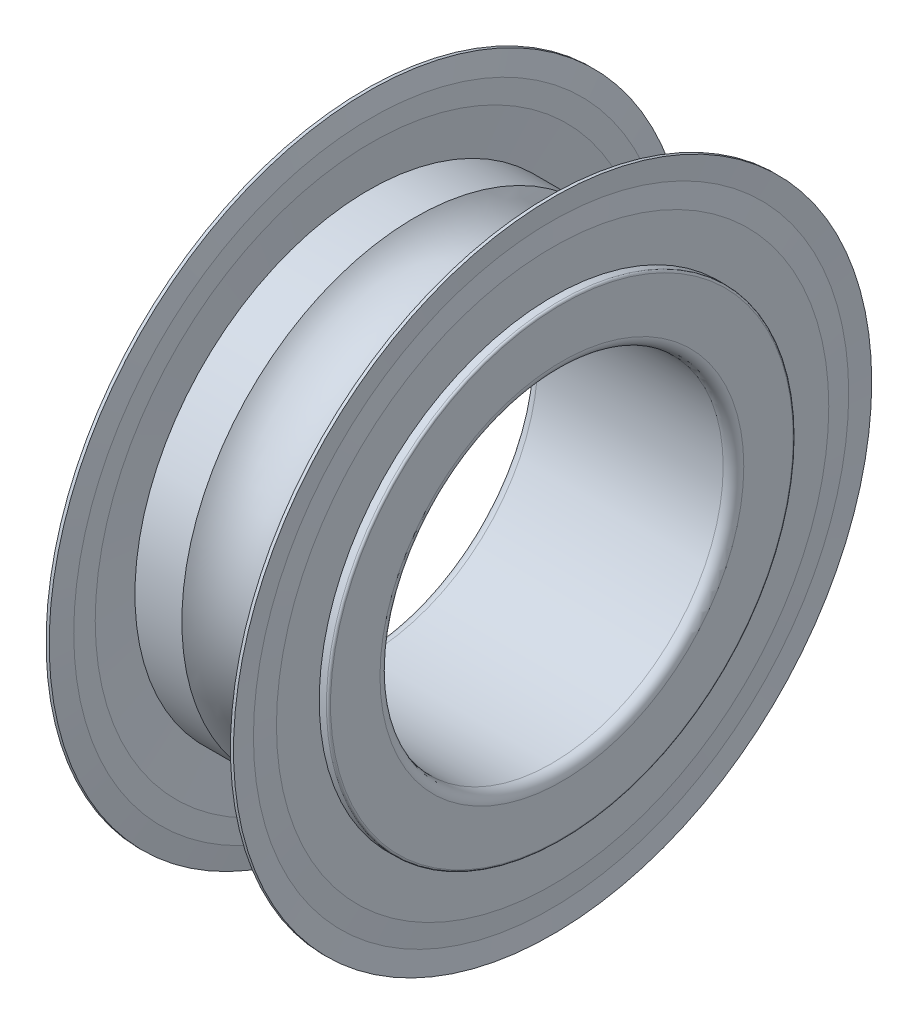
ISO-10303-21;
HEADER;
FILE_DESCRIPTION(('STEP AP214'),'2;1');
FILE_NAME('part.step','',(''),(''),'','','');
FILE_SCHEMA(('AUTOMOTIVE_DESIGN { 1 0 10303 214 1 1 1 1 }'));
ENDSEC;
DATA;
#1=APPLICATION_CONTEXT('core data for automotive mechanical design processes');
#2=APPLICATION_PROTOCOL_DEFINITION('international standard','automotive_design',2000,#1);
#3=PRODUCT_CONTEXT('',#1,'mechanical');
#4=PRODUCT('Part','Part','',(#3));
#5=PRODUCT_RELATED_PRODUCT_CATEGORY('part','',(#4));
#6=PRODUCT_DEFINITION_FORMATION('','',#4);
#7=PRODUCT_DEFINITION_CONTEXT('part definition',#1,'design');
#8=PRODUCT_DEFINITION('design','',#6,#7);
#9=PRODUCT_DEFINITION_SHAPE('','',#8);
#10=(LENGTH_UNIT() NAMED_UNIT(*) SI_UNIT(.MILLI.,.METRE.));
#11=(NAMED_UNIT(*) PLANE_ANGLE_UNIT() SI_UNIT($,.RADIAN.));
#12=(NAMED_UNIT(*) SI_UNIT($,.STERADIAN.) SOLID_ANGLE_UNIT());
#13=UNCERTAINTY_MEASURE_WITH_UNIT(LENGTH_MEASURE(1.E-05),#10,'distance_accuracy_value','');
#14=(GEOMETRIC_REPRESENTATION_CONTEXT(3) GLOBAL_UNCERTAINTY_ASSIGNED_CONTEXT((#13)) GLOBAL_UNIT_ASSIGNED_CONTEXT((#10,
#11,#12)) REPRESENTATION_CONTEXT('',''));
#15=CARTESIAN_POINT('',(0.,0.,0.));
#16=DIRECTION('',(0.,0.,1.));
#17=DIRECTION('',(1.,0.,0.));
#18=AXIS2_PLACEMENT_3D('',#15,#16,#17);
#19=CARTESIAN_POINT('',(50.,0.,0.));
#20=DIRECTION('',(1.,0.,0.));
#21=DIRECTION('',(0.,0.,-1.));
#22=AXIS2_PLACEMENT_3D('',#19,#20,#21);
#23=CYLINDRICAL_SURFACE('',#22,18.595);
#24=CARTESIAN_POINT('',(11.46,0.,0.));
#25=DIRECTION('',(1.,0.,0.));
#26=DIRECTION('',(0.,0.,-1.));
#27=AXIS2_PLACEMENT_3D('',#24,#25,#26);
#28=CIRCLE('',#27,18.595);
#29=CARTESIAN_POINT('',(11.46,0.,-18.595));
#30=VERTEX_POINT('',#29);
#31=EDGE_CURVE('E11',#30,#30,#28,.T.);
#32=ORIENTED_EDGE('',*,*,#31,.F.);
#33=EDGE_LOOP('',(#32));
#34=FACE_BOUND('',#33,.T.);
#35=CARTESIAN_POINT('',(11.28,0.,0.));
#36=DIRECTION('',(1.,0.,0.));
#37=DIRECTION('',(0.,0.,-1.));
#38=AXIS2_PLACEMENT_3D('',#35,#36,#37);
#39=CIRCLE('',#38,18.595);
#40=CARTESIAN_POINT('',(11.28,0.,-18.595));
#41=VERTEX_POINT('',#40);
#42=EDGE_CURVE('E145',#41,#41,#39,.T.);
#43=ORIENTED_EDGE('',*,*,#42,.T.);
#44=EDGE_LOOP('',(#43));
#45=FACE_BOUND('',#44,.T.);
#46=ADVANCED_FACE('F17',(#34,#45),#23,.T.);
#47=CARTESIAN_POINT('',(11.37,0.,0.));
#48=DIRECTION('',(1.,0.,0.));
#49=DIRECTION('',(0.,0.,-1.));
#50=AXIS2_PLACEMENT_3D('',#47,#48,#49);
#51=CONICAL_SURFACE('',#50,17.34375,1.49899191472693);
#52=CARTESIAN_POINT('',(11.37,0.,0.));
#53=DIRECTION('',(1.,0.,0.));
#54=DIRECTION('',(0.,0.,-1.));
#55=AXIS2_PLACEMENT_3D('',#52,#53,#54);
#56=CIRCLE('',#55,17.34375);
#57=CARTESIAN_POINT('',(11.37,0.,-17.34375));
#58=VERTEX_POINT('',#57);
#59=EDGE_CURVE('E27',#58,#58,#56,.T.);
#60=ORIENTED_EDGE('',*,*,#59,.F.);
#61=EDGE_LOOP('',(#60));
#62=FACE_BOUND('',#61,.T.);
#63=ORIENTED_EDGE('',*,*,#31,.T.);
#64=EDGE_LOOP('',(#63));
#65=FACE_BOUND('',#64,.T.);
#66=ADVANCED_FACE('F280',(#62,#65),#51,.F.);
#67=CARTESIAN_POINT('',(11.46,0.,0.));
#68=DIRECTION('',(-1.,0.,0.));
#69=DIRECTION('',(0.,0.,1.));
#70=AXIS2_PLACEMENT_3D('',#67,#68,#69);
#71=CONICAL_SURFACE('',#70,16.0925,1.49899191472693);
#72=CARTESIAN_POINT('',(11.46,0.,0.));
#73=DIRECTION('',(1.,0.,0.));
#74=DIRECTION('',(0.,0.,-1.));
#75=AXIS2_PLACEMENT_3D('',#72,#73,#74);
#76=CIRCLE('',#75,16.0925);
#77=CARTESIAN_POINT('',(11.46,0.,-16.0925));
#78=VERTEX_POINT('',#77);
#79=EDGE_CURVE('E159',#78,#78,#76,.T.);
#80=ORIENTED_EDGE('',*,*,#79,.F.);
#81=EDGE_LOOP('',(#80));
#82=FACE_BOUND('',#81,.T.);
#83=ORIENTED_EDGE('',*,*,#59,.T.);
#84=EDGE_LOOP('',(#83));
#85=FACE_BOUND('',#84,.T.);
#86=ADVANCED_FACE('F270',(#82,#85),#71,.T.);
#87=CARTESIAN_POINT('',(11.46,13.59,0.));
#88=DIRECTION('',(1.,0.,0.));
#89=DIRECTION('',(0.,1.,0.));
#90=AXIS2_PLACEMENT_3D('',#87,#88,#89);
#91=PLANE('',#90);
#92=CARTESIAN_POINT('',(11.46,0.,0.));
#93=DIRECTION('',(-1.,0.,0.));
#94=DIRECTION('',(0.,0.,-1.));
#95=AXIS2_PLACEMENT_3D('',#92,#93,#94);
#96=CIRCLE('',#95,13.6);
#97=CARTESIAN_POINT('',(11.46,0.,-13.6));
#98=VERTEX_POINT('',#97);
#99=EDGE_CURVE('E112',#98,#98,#96,.T.);
#100=ORIENTED_EDGE('',*,*,#99,.T.);
#101=EDGE_LOOP('',(#100));
#102=FACE_BOUND('',#101,.T.);
#103=ORIENTED_EDGE('',*,*,#79,.T.);
#104=EDGE_LOOP('',(#103));
#105=FACE_BOUND('',#104,.T.);
#106=ADVANCED_FACE('F267',(#102,#105),#91,.T.);
#107=CARTESIAN_POINT('',(11.1,0.,0.));
#108=DIRECTION('',(-1.,0.,0.));
#109=DIRECTION('',(0.,0.,1.));
#110=AXIS2_PLACEMENT_3D('',#107,#108,#109);
#111=CONICAL_SURFACE('',#110,16.0925,1.49899191472693);
#112=CARTESIAN_POINT('',(11.1,0.,0.));
#113=DIRECTION('',(1.,0.,0.));
#114=DIRECTION('',(0.,0.,-1.));
#115=AXIS2_PLACEMENT_3D('',#112,#113,#114);
#116=CIRCLE('',#115,16.0925);
#117=CARTESIAN_POINT('',(11.1,0.,-16.0925));
#118=VERTEX_POINT('',#117);
#119=EDGE_CURVE('E161',#118,#118,#116,.T.);
#120=ORIENTED_EDGE('',*,*,#119,.F.);
#121=EDGE_LOOP('',(#120));
#122=FACE_BOUND('',#121,.T.);
#123=CARTESIAN_POINT('',(11.2792807192807,0.,0.));
#124=DIRECTION('',(1.,0.,0.));
#125=DIRECTION('',(0.,0.,1.));
#126=AXIS2_PLACEMENT_3D('',#123,#124,#125);
#127=CIRCLE('',#126,13.6);
#128=CARTESIAN_POINT('',(11.2792807192807,0.,13.6));
#129=VERTEX_POINT('',#128);
#130=EDGE_CURVE('E136',#129,#129,#127,.T.);
#131=ORIENTED_EDGE('',*,*,#130,.T.);
#132=EDGE_LOOP('',(#131));
#133=FACE_BOUND('',#132,.T.);
#134=ADVANCED_FACE('F269',(#122,#133),#111,.F.);
#135=CARTESIAN_POINT('',(11.1,17.34375,0.));
#136=DIRECTION('',(-1.,0.,0.));
#137=DIRECTION('',(0.,0.,1.));
#138=AXIS2_PLACEMENT_3D('',#135,#136,#137);
#139=PLANE('',#138);
#140=CARTESIAN_POINT('',(11.1,0.,0.));
#141=DIRECTION('',(1.,0.,0.));
#142=DIRECTION('',(0.,0.,-1.));
#143=AXIS2_PLACEMENT_3D('',#140,#141,#142);
#144=CIRCLE('',#143,17.34375);
#145=CARTESIAN_POINT('',(11.1,0.,-17.34375));
#146=VERTEX_POINT('',#145);
#147=EDGE_CURVE('E143',#146,#146,#144,.T.);
#148=ORIENTED_EDGE('',*,*,#147,.F.);
#149=EDGE_LOOP('',(#148));
#150=FACE_BOUND('',#149,.T.);
#151=ORIENTED_EDGE('',*,*,#119,.T.);
#152=EDGE_LOOP('',(#151));
#153=FACE_BOUND('',#152,.T.);
#154=ADVANCED_FACE('F277',(#150,#153),#139,.T.);
#155=CARTESIAN_POINT('',(11.28,0.,0.));
#156=DIRECTION('',(1.,0.,0.));
#157=DIRECTION('',(0.,0.,-1.));
#158=AXIS2_PLACEMENT_3D('',#155,#156,#157);
#159=CONICAL_SURFACE('',#158,18.595,1.42792038843124);
#160=ORIENTED_EDGE('',*,*,#42,.F.);
#161=EDGE_LOOP('',(#160));
#162=FACE_BOUND('',#161,.T.);
#163=ORIENTED_EDGE('',*,*,#147,.T.);
#164=EDGE_LOOP('',(#163));
#165=FACE_BOUND('',#164,.T.);
#166=ADVANCED_FACE('F293',(#162,#165),#159,.T.);
#167=CARTESIAN_POINT('',(0.9,0.,0.));
#168=DIRECTION('',(-1.,0.,0.));
#169=DIRECTION('',(0.,0.,1.));
#170=AXIS2_PLACEMENT_3D('',#167,#168,#169);
#171=CONICAL_SURFACE('',#170,17.34375,1.42792038843124);
#172=CARTESIAN_POINT('',(0.9,0.,0.));
#173=DIRECTION('',(1.,0.,0.));
#174=DIRECTION('',(0.,0.,-1.));
#175=AXIS2_PLACEMENT_3D('',#172,#173,#174);
#176=CIRCLE('',#175,17.34375);
#177=CARTESIAN_POINT('',(0.9,0.,-17.34375));
#178=VERTEX_POINT('',#177);
#179=EDGE_CURVE('E124',#178,#178,#176,.T.);
#180=ORIENTED_EDGE('',*,*,#179,.F.);
#181=EDGE_LOOP('',(#180));
#182=FACE_BOUND('',#181,.T.);
#183=CARTESIAN_POINT('',(0.72,0.,0.));
#184=DIRECTION('',(1.,0.,0.));
#185=DIRECTION('',(0.,0.,-1.));
#186=AXIS2_PLACEMENT_3D('',#183,#184,#185);
#187=CIRCLE('',#186,18.595);
#188=CARTESIAN_POINT('',(0.72,0.,-18.595));
#189=VERTEX_POINT('',#188);
#190=EDGE_CURVE('E151',#189,#189,#187,.T.);
#191=ORIENTED_EDGE('',*,*,#190,.T.);
#192=EDGE_LOOP('',(#191));
#193=FACE_BOUND('',#192,.T.);
#194=ADVANCED_FACE('F296',(#182,#193),#171,.T.);
#195=CARTESIAN_POINT('',(0.9,16.0925,0.));
#196=DIRECTION('',(1.,0.,0.));
#197=DIRECTION('',(0.,1.,0.));
#198=AXIS2_PLACEMENT_3D('',#195,#196,#197);
#199=PLANE('',#198);
#200=CARTESIAN_POINT('',(0.9,0.,0.));
#201=DIRECTION('',(1.,0.,0.));
#202=DIRECTION('',(0.,0.,-1.));
#203=AXIS2_PLACEMENT_3D('',#200,#201,#202);
#204=CIRCLE('',#203,16.0925);
#205=CARTESIAN_POINT('',(0.9,0.,-16.0925));
#206=VERTEX_POINT('',#205);
#207=EDGE_CURVE('E155',#206,#206,#204,.T.);
#208=ORIENTED_EDGE('',*,*,#207,.F.);
#209=EDGE_LOOP('',(#208));
#210=FACE_BOUND('',#209,.T.);
#211=ORIENTED_EDGE('',*,*,#179,.T.);
#212=EDGE_LOOP('',(#211));
#213=FACE_BOUND('',#212,.T.);
#214=ADVANCED_FACE('F315',(#210,#213),#199,.T.);
#215=CARTESIAN_POINT('',(0.72,0.,0.));
#216=DIRECTION('',(1.,0.,0.));
#217=DIRECTION('',(0.,0.,-1.));
#218=AXIS2_PLACEMENT_3D('',#215,#216,#217);
#219=CONICAL_SURFACE('',#218,13.59,1.49899191472693);
#220=CARTESIAN_POINT('',(0.720719280719279,0.,0.));
#221=DIRECTION('',(-1.,0.,0.));
#222=DIRECTION('',(0.,0.,-1.));
#223=AXIS2_PLACEMENT_3D('',#220,#221,#222);
#224=CIRCLE('',#223,13.6);
#225=CARTESIAN_POINT('',(0.720719280719279,0.,-13.6));
#226=VERTEX_POINT('',#225);
#227=EDGE_CURVE('E20',#226,#226,#224,.T.);
#228=ORIENTED_EDGE('',*,*,#227,.T.);
#229=EDGE_LOOP('',(#228));
#230=FACE_BOUND('',#229,.T.);
#231=ORIENTED_EDGE('',*,*,#207,.T.);
#232=EDGE_LOOP('',(#231));
#233=FACE_BOUND('',#232,.T.);
#234=ADVANCED_FACE('F312',(#230,#233),#219,.F.);
#235=CARTESIAN_POINT('',(0.54,16.0925,0.));
#236=DIRECTION('',(-1.,0.,0.));
#237=DIRECTION('',(0.,0.,1.));
#238=AXIS2_PLACEMENT_3D('',#235,#236,#237);
#239=PLANE('',#238);
#240=CARTESIAN_POINT('',(0.54,0.,0.));
#241=DIRECTION('',(1.,0.,0.));
#242=DIRECTION('',(0.,0.,-1.));
#243=AXIS2_PLACEMENT_3D('',#240,#241,#242);
#244=CIRCLE('',#243,16.0925);
#245=CARTESIAN_POINT('',(0.54,0.,-16.0925));
#246=VERTEX_POINT('',#245);
#247=EDGE_CURVE('E158',#246,#246,#244,.T.);
#248=ORIENTED_EDGE('',*,*,#247,.F.);
#249=EDGE_LOOP('',(#248));
#250=FACE_BOUND('',#249,.T.);
#251=CARTESIAN_POINT('',(0.54,0.,0.));
#252=DIRECTION('',(1.,0.,0.));
#253=DIRECTION('',(0.,0.,1.));
#254=AXIS2_PLACEMENT_3D('',#251,#252,#253);
#255=CIRCLE('',#254,13.6);
#256=CARTESIAN_POINT('',(0.54,0.,13.6));
#257=VERTEX_POINT('',#256);
#258=EDGE_CURVE('E135',#257,#257,#255,.T.);
#259=ORIENTED_EDGE('',*,*,#258,.T.);
#260=EDGE_LOOP('',(#259));
#261=FACE_BOUND('',#260,.T.);
#262=ADVANCED_FACE('F198',(#250,#261),#239,.T.);
#263=CARTESIAN_POINT('',(0.63,0.,0.));
#264=DIRECTION('',(1.,0.,0.));
#265=DIRECTION('',(0.,0.,-1.));
#266=AXIS2_PLACEMENT_3D('',#263,#264,#265);
#267=CONICAL_SURFACE('',#266,17.34375,1.49899191472693);
#268=CARTESIAN_POINT('',(0.63,0.,0.));
#269=DIRECTION('',(1.,0.,0.));
#270=DIRECTION('',(0.,0.,-1.));
#271=AXIS2_PLACEMENT_3D('',#268,#269,#270);
#272=CIRCLE('',#271,17.34375);
#273=CARTESIAN_POINT('',(0.63,0.,-17.34375));
#274=VERTEX_POINT('',#273);
#275=EDGE_CURVE('E153',#274,#274,#272,.T.);
#276=ORIENTED_EDGE('',*,*,#275,.F.);
#277=EDGE_LOOP('',(#276));
#278=FACE_BOUND('',#277,.T.);
#279=ORIENTED_EDGE('',*,*,#247,.T.);
#280=EDGE_LOOP('',(#279));
#281=FACE_BOUND('',#280,.T.);
#282=ADVANCED_FACE('F310',(#278,#281),#267,.T.);
#283=CARTESIAN_POINT('',(0.54,0.,0.));
#284=DIRECTION('',(-1.,0.,0.));
#285=DIRECTION('',(0.,0.,1.));
#286=AXIS2_PLACEMENT_3D('',#283,#284,#285);
#287=CONICAL_SURFACE('',#286,18.595,1.49899191472693);
#288=CARTESIAN_POINT('',(0.54,0.,0.));
#289=DIRECTION('',(1.,0.,0.));
#290=DIRECTION('',(0.,0.,-1.));
#291=AXIS2_PLACEMENT_3D('',#288,#289,#290);
#292=CIRCLE('',#291,18.595);
#293=CARTESIAN_POINT('',(0.54,0.,-18.595));
#294=VERTEX_POINT('',#293);
#295=EDGE_CURVE('E118',#294,#294,#292,.T.);
#296=ORIENTED_EDGE('',*,*,#295,.F.);
#297=EDGE_LOOP('',(#296));
#298=FACE_BOUND('',#297,.T.);
#299=ORIENTED_EDGE('',*,*,#275,.T.);
#300=EDGE_LOOP('',(#299));
#301=FACE_BOUND('',#300,.T.);
#302=ADVANCED_FACE('F306',(#298,#301),#287,.F.);
#303=CARTESIAN_POINT('',(50.,0.,0.));
#304=DIRECTION('',(1.,0.,0.));
#305=DIRECTION('',(0.,0.,-1.));
#306=AXIS2_PLACEMENT_3D('',#303,#304,#305);
#307=CYLINDRICAL_SURFACE('',#306,18.595);
#308=ORIENTED_EDGE('',*,*,#190,.F.);
#309=EDGE_LOOP('',(#308));
#310=FACE_BOUND('',#309,.T.);
#311=ORIENTED_EDGE('',*,*,#295,.T.);
#312=EDGE_LOOP('',(#311));
#313=FACE_BOUND('',#312,.T.);
#314=ADVANCED_FACE('F309',(#310,#313),#307,.T.);
#315=CARTESIAN_POINT('',(50.,0.,0.));
#316=DIRECTION('',(1.,0.,0.));
#317=DIRECTION('',(0.,0.,-1.));
#318=AXIS2_PLACEMENT_3D('',#315,#316,#317);
#319=CYLINDRICAL_SURFACE('',#318,13.6);
#320=CARTESIAN_POINT('',(3.45625767814427,0.,0.));
#321=DIRECTION('',(1.,0.,0.));
#322=DIRECTION('',(0.,0.,-1.));
#323=AXIS2_PLACEMENT_3D('',#320,#321,#322);
#324=CIRCLE('',#323,13.6);
#325=CARTESIAN_POINT('',(3.45625767814427,0.,-13.6));
#326=VERTEX_POINT('',#325);
#327=EDGE_CURVE('E107',#326,#326,#324,.T.);
#328=ORIENTED_EDGE('',*,*,#327,.F.);
#329=EDGE_LOOP('',(#328));
#330=FACE_BOUND('',#329,.T.);
#331=ORIENTED_EDGE('',*,*,#227,.F.);
#332=EDGE_LOOP('',(#331));
#333=FACE_BOUND('',#332,.T.);
#334=ADVANCED_FACE('F321',(#330,#333),#319,.T.);
#335=CARTESIAN_POINT('',(6.,0.,0.));
#336=DIRECTION('',(1.,0.,0.));
#337=DIRECTION('',(0.,0.,-1.));
#338=AXIS2_PLACEMENT_3D('',#335,#336,#337);
#339=TOROIDAL_SURFACE('',#338,15.5,3.175);
#340=ORIENTED_EDGE('',*,*,#327,.T.);
#341=EDGE_LOOP('',(#340));
#342=FACE_BOUND('',#341,.T.);
#343=CARTESIAN_POINT('',(8.54374232185574,0.,0.));
#344=DIRECTION('',(1.,0.,0.));
#345=DIRECTION('',(0.,0.,-1.));
#346=AXIS2_PLACEMENT_3D('',#343,#344,#345);
#347=CIRCLE('',#346,13.6);
#348=CARTESIAN_POINT('',(8.54374232185574,0.,-13.6));
#349=VERTEX_POINT('',#348);
#350=EDGE_CURVE('E189',#349,#349,#347,.T.);
#351=ORIENTED_EDGE('',*,*,#350,.F.);
#352=EDGE_LOOP('',(#351));
#353=FACE_BOUND('',#352,.T.);
#354=ADVANCED_FACE('F108',(#342,#353),#339,.F.);
#355=CARTESIAN_POINT('',(50.,0.,0.));
#356=DIRECTION('',(1.,0.,0.));
#357=DIRECTION('',(0.,0.,-1.));
#358=AXIS2_PLACEMENT_3D('',#355,#356,#357);
#359=CYLINDRICAL_SURFACE('',#358,13.6);
#360=CARTESIAN_POINT('',(11.88,0.,0.));
#361=DIRECTION('',(1.,0.,0.));
#362=DIRECTION('',(0.,0.,-1.));
#363=AXIS2_PLACEMENT_3D('',#360,#361,#362);
#364=CIRCLE('',#363,13.6);
#365=CARTESIAN_POINT('',(11.88,0.,-13.6));
#366=VERTEX_POINT('',#365);
#367=EDGE_CURVE('E120',#366,#366,#364,.T.);
#368=ORIENTED_EDGE('',*,*,#367,.F.);
#369=EDGE_LOOP('',(#368));
#370=FACE_BOUND('',#369,.T.);
#371=ORIENTED_EDGE('',*,*,#99,.F.);
#372=EDGE_LOOP('',(#371));
#373=FACE_BOUND('',#372,.T.);
#374=ADVANCED_FACE('F257',(#370,#373),#359,.T.);
#375=CARTESIAN_POINT('',(11.88,0.,0.));
#376=DIRECTION('',(1.,0.,0.));
#377=DIRECTION('',(0.,0.,-1.));
#378=AXIS2_PLACEMENT_3D('',#375,#376,#377);
#379=TOROIDAL_SURFACE('',#378,13.48,0.12);
#380=CARTESIAN_POINT('',(12.,0.,0.));
#381=DIRECTION('',(1.,0.,0.));
#382=DIRECTION('',(0.,0.,-1.));
#383=AXIS2_PLACEMENT_3D('',#380,#381,#382);
#384=CIRCLE('',#383,13.48);
#385=CARTESIAN_POINT('',(12.,0.,-13.48));
#386=VERTEX_POINT('',#385);
#387=EDGE_CURVE('E129',#386,#386,#384,.T.);
#388=ORIENTED_EDGE('',*,*,#387,.F.);
#389=EDGE_LOOP('',(#388));
#390=FACE_BOUND('',#389,.T.);
#391=ORIENTED_EDGE('',*,*,#367,.T.);
#392=EDGE_LOOP('',(#391));
#393=FACE_BOUND('',#392,.T.);
#394=ADVANCED_FACE('F251',(#390,#393),#379,.T.);
#395=CARTESIAN_POINT('',(12.,10.6,0.));
#396=DIRECTION('',(1.,0.,0.));
#397=DIRECTION('',(0.,1.,0.));
#398=AXIS2_PLACEMENT_3D('',#395,#396,#397);
#399=PLANE('',#398);
#400=CARTESIAN_POINT('',(12.,0.,0.));
#401=DIRECTION('',(1.,0.,0.));
#402=DIRECTION('',(0.,0.,-1.));
#403=AXIS2_PLACEMENT_3D('',#400,#401,#402);
#404=CIRCLE('',#403,10.6);
#405=CARTESIAN_POINT('',(12.,0.,-10.6));
#406=VERTEX_POINT('',#405);
#407=EDGE_CURVE('E126',#406,#406,#404,.T.);
#408=ORIENTED_EDGE('',*,*,#407,.F.);
#409=EDGE_LOOP('',(#408));
#410=FACE_BOUND('',#409,.T.);
#411=ORIENTED_EDGE('',*,*,#387,.T.);
#412=EDGE_LOOP('',(#411));
#413=FACE_BOUND('',#412,.T.);
#414=ADVANCED_FACE('F243',(#410,#413),#399,.T.);
#415=CARTESIAN_POINT('',(11.4,0.,0.));
#416=DIRECTION('',(1.,0.,0.));
#417=DIRECTION('',(0.,0.,-1.));
#418=AXIS2_PLACEMENT_3D('',#415,#416,#417);
#419=TOROIDAL_SURFACE('',#418,10.6,0.6);
#420=CARTESIAN_POINT('',(11.4,0.,0.));
#421=DIRECTION('',(1.,0.,0.));
#422=DIRECTION('',(0.,0.,-1.));
#423=AXIS2_PLACEMENT_3D('',#420,#421,#422);
#424=CIRCLE('',#423,10.);
#425=CARTESIAN_POINT('',(11.4,0.,-10.));
#426=VERTEX_POINT('',#425);
#427=EDGE_CURVE('E130',#426,#426,#424,.T.);
#428=ORIENTED_EDGE('',*,*,#427,.F.);
#429=EDGE_LOOP('',(#428));
#430=FACE_BOUND('',#429,.T.);
#431=ORIENTED_EDGE('',*,*,#407,.T.);
#432=EDGE_LOOP('',(#431));
#433=FACE_BOUND('',#432,.T.);
#434=ADVANCED_FACE('F237',(#430,#433),#419,.T.);
#435=CARTESIAN_POINT('',(50.,0.,0.));
#436=DIRECTION('',(1.,0.,0.));
#437=DIRECTION('',(0.,0.,-1.));
#438=AXIS2_PLACEMENT_3D('',#435,#436,#437);
#439=CYLINDRICAL_SURFACE('',#438,10.);
#440=CARTESIAN_POINT('',(0.6,0.,0.));
#441=DIRECTION('',(1.,0.,0.));
#442=DIRECTION('',(0.,0.,-1.));
#443=AXIS2_PLACEMENT_3D('',#440,#441,#442);
#444=CIRCLE('',#443,10.);
#445=CARTESIAN_POINT('',(0.6,0.,-10.));
#446=VERTEX_POINT('',#445);
#447=EDGE_CURVE('E141',#446,#446,#444,.T.);
#448=ORIENTED_EDGE('',*,*,#447,.F.);
#449=EDGE_LOOP('',(#448));
#450=FACE_BOUND('',#449,.T.);
#451=ORIENTED_EDGE('',*,*,#427,.T.);
#452=EDGE_LOOP('',(#451));
#453=FACE_BOUND('',#452,.T.);
#454=ADVANCED_FACE('F231',(#450,#453),#439,.F.);
#455=CARTESIAN_POINT('',(0.6,0.,0.));
#456=DIRECTION('',(1.,0.,0.));
#457=DIRECTION('',(0.,0.,-1.));
#458=AXIS2_PLACEMENT_3D('',#455,#456,#457);
#459=TOROIDAL_SURFACE('',#458,10.6,0.6);
#460=CARTESIAN_POINT('',(0.,0.,0.));
#461=DIRECTION('',(1.,0.,0.));
#462=DIRECTION('',(0.,0.,-1.));
#463=AXIS2_PLACEMENT_3D('',#460,#461,#462);
#464=CIRCLE('',#463,10.6);
#465=CARTESIAN_POINT('',(0.,0.,-10.6));
#466=VERTEX_POINT('',#465);
#467=EDGE_CURVE('E137',#466,#466,#464,.T.);
#468=ORIENTED_EDGE('',*,*,#467,.F.);
#469=EDGE_LOOP('',(#468));
#470=FACE_BOUND('',#469,.T.);
#471=ORIENTED_EDGE('',*,*,#447,.T.);
#472=EDGE_LOOP('',(#471));
#473=FACE_BOUND('',#472,.T.);
#474=ADVANCED_FACE('F225',(#470,#473),#459,.T.);
#475=CARTESIAN_POINT('',(0.,13.48,0.));
#476=DIRECTION('',(-1.,0.,0.));
#477=DIRECTION('',(0.,0.,1.));
#478=AXIS2_PLACEMENT_3D('',#475,#476,#477);
#479=PLANE('',#478);
#480=CARTESIAN_POINT('',(0.,0.,0.));
#481=DIRECTION('',(1.,0.,0.));
#482=DIRECTION('',(0.,0.,-1.));
#483=AXIS2_PLACEMENT_3D('',#480,#481,#482);
#484=CIRCLE('',#483,13.48);
#485=CARTESIAN_POINT('',(0.,0.,-13.48));
#486=VERTEX_POINT('',#485);
#487=EDGE_CURVE('E142',#486,#486,#484,.T.);
#488=ORIENTED_EDGE('',*,*,#487,.F.);
#489=EDGE_LOOP('',(#488));
#490=FACE_BOUND('',#489,.T.);
#491=ORIENTED_EDGE('',*,*,#467,.T.);
#492=EDGE_LOOP('',(#491));
#493=FACE_BOUND('',#492,.T.);
#494=ADVANCED_FACE('F217',(#490,#493),#479,.T.);
#495=CARTESIAN_POINT('',(0.12,0.,0.));
#496=DIRECTION('',(1.,0.,0.));
#497=DIRECTION('',(0.,0.,-1.));
#498=AXIS2_PLACEMENT_3D('',#495,#496,#497);
#499=TOROIDAL_SURFACE('',#498,13.48,0.12);
#500=CARTESIAN_POINT('',(0.120000000000002,0.,0.));
#501=DIRECTION('',(1.,0.,0.));
#502=DIRECTION('',(0.,0.,-1.));
#503=AXIS2_PLACEMENT_3D('',#500,#501,#502);
#504=CIRCLE('',#503,13.6);
#505=CARTESIAN_POINT('',(0.120000000000002,0.,-13.6));
#506=VERTEX_POINT('',#505);
#507=EDGE_CURVE('E131',#506,#506,#504,.T.);
#508=ORIENTED_EDGE('',*,*,#507,.F.);
#509=EDGE_LOOP('',(#508));
#510=FACE_BOUND('',#509,.T.);
#511=ORIENTED_EDGE('',*,*,#487,.T.);
#512=EDGE_LOOP('',(#511));
#513=FACE_BOUND('',#512,.T.);
#514=ADVANCED_FACE('F208',(#510,#513),#499,.T.);
#515=CARTESIAN_POINT('',(50.,0.,0.));
#516=DIRECTION('',(1.,0.,0.));
#517=DIRECTION('',(0.,0.,-1.));
#518=AXIS2_PLACEMENT_3D('',#515,#516,#517);
#519=CYLINDRICAL_SURFACE('',#518,13.6);
#520=ORIENTED_EDGE('',*,*,#258,.F.);
#521=EDGE_LOOP('',(#520));
#522=FACE_BOUND('',#521,.T.);
#523=ORIENTED_EDGE('',*,*,#507,.T.);
#524=EDGE_LOOP('',(#523));
#525=FACE_BOUND('',#524,.T.);
#526=ADVANCED_FACE('F204',(#522,#525),#519,.T.);
#527=CARTESIAN_POINT('',(50.,0.,0.));
#528=DIRECTION('',(1.,0.,0.));
#529=DIRECTION('',(0.,0.,-1.));
#530=AXIS2_PLACEMENT_3D('',#527,#528,#529);
#531=CYLINDRICAL_SURFACE('',#530,13.6);
#532=ORIENTED_EDGE('',*,*,#130,.F.);
#533=EDGE_LOOP('',(#532));
#534=FACE_BOUND('',#533,.T.);
#535=ORIENTED_EDGE('',*,*,#350,.T.);
#536=EDGE_LOOP('',(#535));
#537=FACE_BOUND('',#536,.T.);
#538=ADVANCED_FACE('F207',(#534,#537),#531,.T.);
#539=CLOSED_SHELL('',(#46,#66,#86,#106,#134,#154,#166,#194,#214,#234,#262,#282,#302,#314,#334,
#354,#374,#394,#414,#434,#454,#474,#494,#514,#526,#538));
#540=MANIFOLD_SOLID_BREP('B1',#539);
#541=ADVANCED_BREP_SHAPE_REPRESENTATION('',(#18,#540),#14);
#542=SHAPE_DEFINITION_REPRESENTATION(#9,#541);
ENDSEC;
END-ISO-10303-21;
